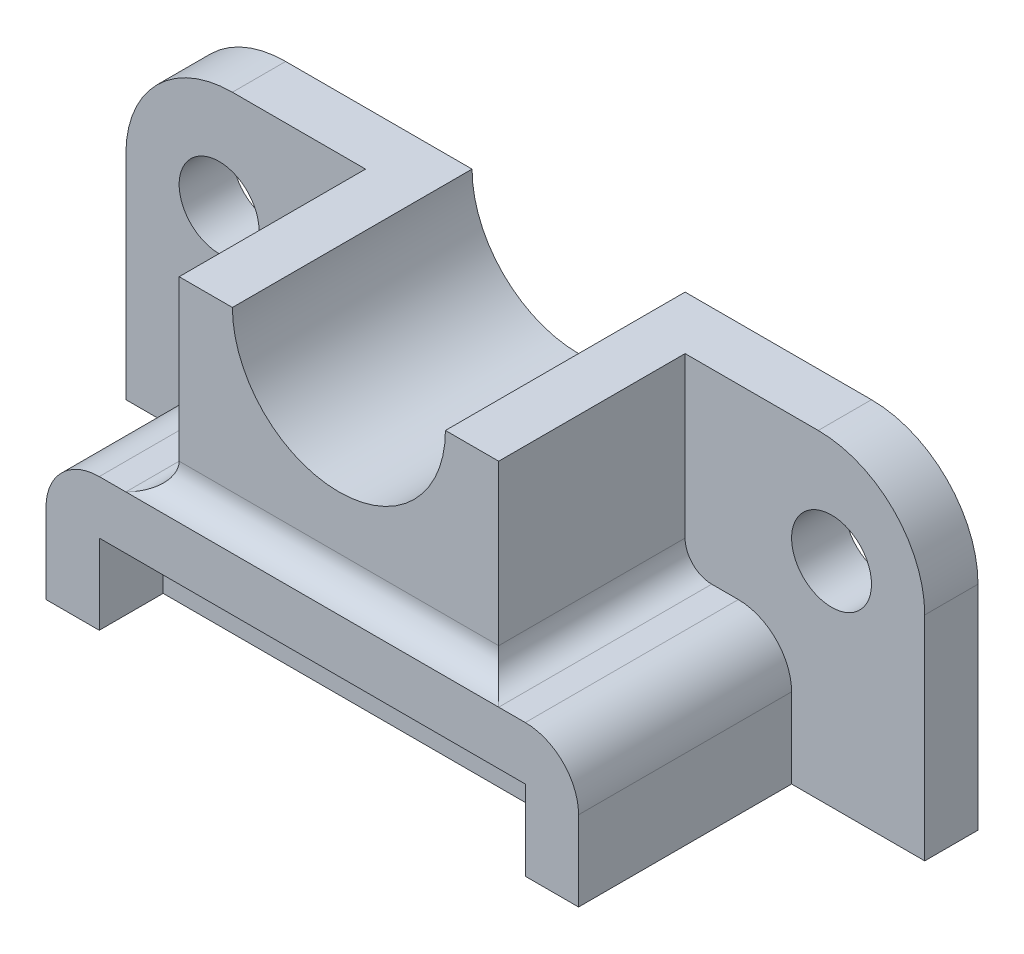
ISO-10303-21;
HEADER;
FILE_DESCRIPTION(('STEP AP214'),'2;1');
FILE_NAME('part.step','',(''),(''),'','','');
FILE_SCHEMA(('AUTOMOTIVE_DESIGN { 1 0 10303 214 1 1 1 1 }'));
ENDSEC;
DATA;
#1=APPLICATION_CONTEXT('core data for automotive mechanical design processes');
#2=APPLICATION_PROTOCOL_DEFINITION('international standard','automotive_design',2000,#1);
#3=PRODUCT_CONTEXT('',#1,'mechanical');
#4=PRODUCT('Part','Part','',(#3));
#5=PRODUCT_RELATED_PRODUCT_CATEGORY('part','',(#4));
#6=PRODUCT_DEFINITION_FORMATION('','',#4);
#7=PRODUCT_DEFINITION_CONTEXT('part definition',#1,'design');
#8=PRODUCT_DEFINITION('design','',#6,#7);
#9=PRODUCT_DEFINITION_SHAPE('','',#8);
#10=(LENGTH_UNIT() NAMED_UNIT(*) SI_UNIT(.MILLI.,.METRE.));
#11=(NAMED_UNIT(*) PLANE_ANGLE_UNIT() SI_UNIT($,.RADIAN.));
#12=(NAMED_UNIT(*) SI_UNIT($,.STERADIAN.) SOLID_ANGLE_UNIT());
#13=UNCERTAINTY_MEASURE_WITH_UNIT(LENGTH_MEASURE(1.E-05),#10,'distance_accuracy_value','');
#14=(GEOMETRIC_REPRESENTATION_CONTEXT(3) GLOBAL_UNCERTAINTY_ASSIGNED_CONTEXT((#13)) GLOBAL_UNIT_ASSIGNED_CONTEXT((#10,
#11,#12)) REPRESENTATION_CONTEXT('',''));
#15=CARTESIAN_POINT('',(0.,0.,0.));
#16=DIRECTION('',(0.,0.,1.));
#17=DIRECTION('',(1.,0.,0.));
#18=AXIS2_PLACEMENT_3D('',#15,#16,#17);
#19=CARTESIAN_POINT('',(0.,-5.,50.));
#20=DIRECTION('',(0.,-1.,0.));
#21=DIRECTION('',(1.,0.,0.));
#22=AXIS2_PLACEMENT_3D('',#19,#20,#21);
#23=PLANE('',#22);
#24=DIRECTION('',(-1.,0.,0.));
#25=VECTOR('',#24,1.);
#26=CARTESIAN_POINT('',(0.,-5.,50.));
#27=LINE('',#26,#25);
#28=CARTESIAN_POINT('',(-35.,-5.,50.));
#29=VERTEX_POINT('',#28);
#30=CARTESIAN_POINT('',(-40.,-5.00000000000001,50.));
#31=VERTEX_POINT('',#30);
#32=EDGE_CURVE('E366',#29,#31,#27,.T.);
#33=ORIENTED_EDGE('',*,*,#32,.F.);
#34=DIRECTION('',(0.,0.,-1.));
#35=VECTOR('',#34,1.);
#36=CARTESIAN_POINT('',(-35.,-5.,10.));
#37=LINE('',#36,#35);
#38=CARTESIAN_POINT('',(-35.,-5.,10.));
#39=VERTEX_POINT('',#38);
#40=EDGE_CURVE('E313',#29,#39,#37,.T.);
#41=ORIENTED_EDGE('',*,*,#40,.T.);
#42=DIRECTION('',(-1.,0.,0.));
#43=VECTOR('',#42,1.);
#44=CARTESIAN_POINT('',(0.,-5.,10.));
#45=LINE('',#44,#43);
#46=CARTESIAN_POINT('',(-40.,-5.00000000000001,10.));
#47=VERTEX_POINT('',#46);
#48=EDGE_CURVE('E308',#39,#47,#45,.T.);
#49=ORIENTED_EDGE('',*,*,#48,.T.);
#50=DIRECTION('',(0.,0.,-1.));
#51=VECTOR('',#50,1.);
#52=CARTESIAN_POINT('',(-40.,-5.00000000000001,50.));
#53=LINE('',#52,#51);
#54=EDGE_CURVE('E286',#47,#31,#53,.F.);
#55=ORIENTED_EDGE('',*,*,#54,.T.);
#56=EDGE_LOOP('',(#33,#41,#49,#55));
#57=FACE_BOUND('',#56,.T.);
#58=ADVANCED_FACE('F34',(#57),#23,.F.);
#59=CARTESIAN_POINT('',(75.,30.,10.));
#60=DIRECTION('',(0.,-1.,0.));
#61=DIRECTION('',(1.,0.,0.));
#62=AXIS2_PLACEMENT_3D('',#59,#60,#61);
#63=PLANE('',#62);
#64=DIRECTION('',(-1.,0.,0.));
#65=VECTOR('',#64,1.);
#66=CARTESIAN_POINT('',(75.,30.,0.));
#67=LINE('',#66,#65);
#68=CARTESIAN_POINT('',(55.,30.,0.));
#69=VERTEX_POINT('',#68);
#70=CARTESIAN_POINT('',(20.,30.,0.));
#71=VERTEX_POINT('',#70);
#72=EDGE_CURVE('E234',#69,#71,#67,.T.);
#73=ORIENTED_EDGE('',*,*,#72,.T.);
#74=DIRECTION('',(0.,0.,-1.));
#75=VECTOR('',#74,1.);
#76=CARTESIAN_POINT('',(20.,30.,45.));
#77=LINE('',#76,#75);
#78=CARTESIAN_POINT('',(20.,30.,45.));
#79=VERTEX_POINT('',#78);
#80=EDGE_CURVE('E354',#79,#71,#77,.T.);
#81=ORIENTED_EDGE('',*,*,#80,.F.);
#82=DIRECTION('',(-1.,0.,0.));
#83=VECTOR('',#82,1.);
#84=CARTESIAN_POINT('',(0.,30.,45.));
#85=LINE('',#84,#83);
#86=CARTESIAN_POINT('',(30.,30.,45.));
#87=VERTEX_POINT('',#86);
#88=EDGE_CURVE('E332',#87,#79,#85,.T.);
#89=ORIENTED_EDGE('',*,*,#88,.F.);
#90=DIRECTION('',(0.,0.,-1.));
#91=VECTOR('',#90,1.);
#92=CARTESIAN_POINT('',(30.,30.,45.));
#93=LINE('',#92,#91);
#94=CARTESIAN_POINT('',(30.,30.,10.));
#95=VERTEX_POINT('',#94);
#96=EDGE_CURVE('E345',#87,#95,#93,.T.);
#97=ORIENTED_EDGE('',*,*,#96,.T.);
#98=DIRECTION('',(-1.,0.,0.));
#99=VECTOR('',#98,1.);
#100=CARTESIAN_POINT('',(75.,30.,10.));
#101=LINE('',#100,#99);
#102=CARTESIAN_POINT('',(55.,30.,10.));
#103=VERTEX_POINT('',#102);
#104=EDGE_CURVE('E242',#103,#95,#101,.T.);
#105=ORIENTED_EDGE('',*,*,#104,.F.);
#106=DIRECTION('',(0.,0.,-1.));
#107=VECTOR('',#106,1.);
#108=CARTESIAN_POINT('',(55.,30.,10.));
#109=LINE('',#108,#107);
#110=EDGE_CURVE('E263',#103,#69,#109,.T.);
#111=ORIENTED_EDGE('',*,*,#110,.T.);
#112=EDGE_LOOP('',(#73,#81,#89,#97,#105,#111));
#113=FACE_BOUND('',#112,.T.);
#114=ADVANCED_FACE('F451',(#113),#63,.F.);
#115=CARTESIAN_POINT('',(0.,0.,10.));
#116=DIRECTION('',(0.,0.,1.));
#117=DIRECTION('',(1.,0.,0.));
#118=AXIS2_PLACEMENT_3D('',#115,#116,#117);
#119=PLANE('',#118);
#120=CARTESIAN_POINT('',(-57.5,10.,10.));
#121=DIRECTION('',(0.,0.,1.));
#122=DIRECTION('',(1.,0.,0.));
#123=AXIS2_PLACEMENT_3D('',#120,#121,#122);
#124=CIRCLE('',#123,7.5);
#125=CARTESIAN_POINT('',(-50.,10.,10.));
#126=VERTEX_POINT('',#125);
#127=EDGE_CURVE('E305',#126,#126,#124,.T.);
#128=ORIENTED_EDGE('',*,*,#127,.F.);
#129=EDGE_LOOP('',(#128));
#130=FACE_BOUND('',#129,.T.);
#131=ORIENTED_EDGE('',*,*,#48,.F.);
#132=CARTESIAN_POINT('',(-35.,0.,10.));
#133=DIRECTION('',(0.,0.,1.));
#134=DIRECTION('',(1.,0.,0.));
#135=AXIS2_PLACEMENT_3D('',#132,#133,#134);
#136=CIRCLE('',#135,5.);
#137=CARTESIAN_POINT('',(-30.,0.,10.));
#138=VERTEX_POINT('',#137);
#139=EDGE_CURVE('E317',#39,#138,#136,.T.);
#140=ORIENTED_EDGE('',*,*,#139,.T.);
#141=DIRECTION('',(0.,-1.,0.));
#142=VECTOR('',#141,1.);
#143=CARTESIAN_POINT('',(-30.,0.,10.));
#144=LINE('',#143,#142);
#145=CARTESIAN_POINT('',(-30.,30.,10.));
#146=VERTEX_POINT('',#145);
#147=EDGE_CURVE('E328',#146,#138,#144,.T.);
#148=ORIENTED_EDGE('',*,*,#147,.F.);
#149=CARTESIAN_POINT('',(-55.,30.,10.));
#150=VERTEX_POINT('',#149);
#151=EDGE_CURVE('E241',#146,#150,#101,.T.);
#152=ORIENTED_EDGE('',*,*,#151,.T.);
#153=CARTESIAN_POINT('',(-55.,10.,10.));
#154=DIRECTION('',(0.,0.,1.));
#155=DIRECTION('',(1.,0.,0.));
#156=AXIS2_PLACEMENT_3D('',#153,#154,#155);
#157=CIRCLE('',#156,20.);
#158=CARTESIAN_POINT('',(-75.,10.,10.));
#159=VERTEX_POINT('',#158);
#160=EDGE_CURVE('E273',#150,#159,#157,.T.);
#161=ORIENTED_EDGE('',*,*,#160,.T.);
#162=DIRECTION('',(0.,-1.,0.));
#163=VECTOR('',#162,1.);
#164=CARTESIAN_POINT('',(-75.,-30.,10.));
#165=LINE('',#164,#163);
#166=CARTESIAN_POINT('',(-75.,-30.,10.));
#167=VERTEX_POINT('',#166);
#168=EDGE_CURVE('E231',#159,#167,#165,.T.);
#169=ORIENTED_EDGE('',*,*,#168,.T.);
#170=DIRECTION('',(1.,0.,0.));
#171=VECTOR('',#170,1.);
#172=CARTESIAN_POINT('',(75.,-30.,10.));
#173=LINE('',#172,#171);
#174=CARTESIAN_POINT('',(-50.,-30.,10.));
#175=VERTEX_POINT('',#174);
#176=EDGE_CURVE('E235',#167,#175,#173,.T.);
#177=ORIENTED_EDGE('',*,*,#176,.T.);
#178=DIRECTION('',(0.,-1.,0.));
#179=VECTOR('',#178,1.);
#180=CARTESIAN_POINT('',(-50.,0.,10.));
#181=LINE('',#180,#179);
#182=CARTESIAN_POINT('',(-50.,-15.,10.));
#183=VERTEX_POINT('',#182);
#184=EDGE_CURVE('E382',#183,#175,#181,.T.);
#185=ORIENTED_EDGE('',*,*,#184,.F.);
#186=CARTESIAN_POINT('',(-40.,-15.,10.));
#187=DIRECTION('',(0.,0.,1.));
#188=DIRECTION('',(1.,0.,0.));
#189=AXIS2_PLACEMENT_3D('',#186,#187,#188);
#190=CIRCLE('',#189,10.);
#191=EDGE_CURVE('E295',#183,#47,#190,.F.);
#192=ORIENTED_EDGE('',*,*,#191,.T.);
#193=EDGE_LOOP('',(#131,#140,#148,#152,#161,#169,#177,#185,#192));
#194=FACE_BOUND('',#193,.T.);
#195=ADVANCED_FACE('F432',(#130,#194),#119,.T.);
#196=CARTESIAN_POINT('',(40.,-4.99999999999999,10.));
#197=VERTEX_POINT('',#196);
#198=CARTESIAN_POINT('',(35.,-5.,10.));
#199=VERTEX_POINT('',#198);
#200=EDGE_CURVE('E379',#197,#199,#45,.T.);
#201=ORIENTED_EDGE('',*,*,#200,.T.);
#202=DIRECTION('',(0.,0.,-1.));
#203=VECTOR('',#202,1.);
#204=CARTESIAN_POINT('',(35.,-5.,50.));
#205=LINE('',#204,#203);
#206=CARTESIAN_POINT('',(35.,-5.,50.));
#207=VERTEX_POINT('',#206);
#208=EDGE_CURVE('E311',#199,#207,#205,.F.);
#209=ORIENTED_EDGE('',*,*,#208,.T.);
#210=CARTESIAN_POINT('',(40.,-4.99999999999999,50.));
#211=VERTEX_POINT('',#210);
#212=EDGE_CURVE('E361',#211,#207,#27,.T.);
#213=ORIENTED_EDGE('',*,*,#212,.F.);
#214=DIRECTION('',(0.,0.,-1.));
#215=VECTOR('',#214,1.);
#216=CARTESIAN_POINT('',(40.,-4.99999999999999,50.));
#217=LINE('',#216,#215);
#218=EDGE_CURVE('E283',#211,#197,#217,.T.);
#219=ORIENTED_EDGE('',*,*,#218,.T.);
#220=EDGE_LOOP('',(#201,#209,#213,#219));
#221=FACE_BOUND('',#220,.T.);
#222=ADVANCED_FACE('F409',(#221),#23,.F.);
#223=CARTESIAN_POINT('',(-75.,-30.,10.));
#224=DIRECTION('',(1.,0.,0.));
#225=DIRECTION('',(0.,0.,-1.));
#226=AXIS2_PLACEMENT_3D('',#223,#224,#225);
#227=PLANE('',#226);
#228=ORIENTED_EDGE('',*,*,#168,.F.);
#229=DIRECTION('',(0.,0.,-1.));
#230=VECTOR('',#229,1.);
#231=CARTESIAN_POINT('',(-75.,10.,10.));
#232=LINE('',#231,#230);
#233=CARTESIAN_POINT('',(-75.,10.,0.));
#234=VERTEX_POINT('',#233);
#235=EDGE_CURVE('E277',#159,#234,#232,.T.);
#236=ORIENTED_EDGE('',*,*,#235,.T.);
#237=DIRECTION('',(0.,-1.,0.));
#238=VECTOR('',#237,1.);
#239=CARTESIAN_POINT('',(-75.,-30.,0.));
#240=LINE('',#239,#238);
#241=CARTESIAN_POINT('',(-75.,-30.,0.));
#242=VERTEX_POINT('',#241);
#243=EDGE_CURVE('E230',#234,#242,#240,.T.);
#244=ORIENTED_EDGE('',*,*,#243,.T.);
#245=DIRECTION('',(0.,0.,-1.));
#246=VECTOR('',#245,1.);
#247=CARTESIAN_POINT('',(-75.,-30.,10.));
#248=LINE('',#247,#246);
#249=EDGE_CURVE('E257',#167,#242,#248,.T.);
#250=ORIENTED_EDGE('',*,*,#249,.F.);
#251=EDGE_LOOP('',(#228,#236,#244,#250));
#252=FACE_BOUND('',#251,.T.);
#253=ADVANCED_FACE('F461',(#252),#227,.F.);
#254=CARTESIAN_POINT('',(75.,-30.,10.));
#255=DIRECTION('',(0.,1.,0.));
#256=DIRECTION('',(-1.,0.,0.));
#257=AXIS2_PLACEMENT_3D('',#254,#255,#256);
#258=PLANE('',#257);
#259=DIRECTION('',(1.,0.,0.));
#260=VECTOR('',#259,1.);
#261=CARTESIAN_POINT('',(75.,-30.,0.));
#262=LINE('',#261,#260);
#263=CARTESIAN_POINT('',(75.,-30.,0.));
#264=VERTEX_POINT('',#263);
#265=EDGE_CURVE('E247',#242,#264,#262,.T.);
#266=ORIENTED_EDGE('',*,*,#265,.T.);
#267=DIRECTION('',(0.,0.,-1.));
#268=VECTOR('',#267,1.);
#269=CARTESIAN_POINT('',(75.,-30.,10.));
#270=LINE('',#269,#268);
#271=CARTESIAN_POINT('',(75.,-30.,10.));
#272=VERTEX_POINT('',#271);
#273=EDGE_CURVE('E245',#272,#264,#270,.T.);
#274=ORIENTED_EDGE('',*,*,#273,.F.);
#275=CARTESIAN_POINT('',(50.,-30.,10.));
#276=VERTEX_POINT('',#275);
#277=EDGE_CURVE('E233',#276,#272,#173,.T.);
#278=ORIENTED_EDGE('',*,*,#277,.F.);
#279=DIRECTION('',(0.,0.,-1.));
#280=VECTOR('',#279,1.);
#281=CARTESIAN_POINT('',(50.,-30.,50.));
#282=LINE('',#281,#280);
#283=CARTESIAN_POINT('',(50.,-30.,50.));
#284=VERTEX_POINT('',#283);
#285=EDGE_CURVE('E221',#284,#276,#282,.T.);
#286=ORIENTED_EDGE('',*,*,#285,.F.);
#287=DIRECTION('',(1.,0.,0.));
#288=VECTOR('',#287,1.);
#289=CARTESIAN_POINT('',(0.,-30.,50.));
#290=LINE('',#289,#288);
#291=CARTESIAN_POINT('',(40.,-30.,50.));
#292=VERTEX_POINT('',#291);
#293=EDGE_CURVE('E371',#292,#284,#290,.T.);
#294=ORIENTED_EDGE('',*,*,#293,.F.);
#295=DIRECTION('',(0.,0.,-1.));
#296=VECTOR('',#295,1.);
#297=CARTESIAN_POINT('',(40.,-30.,50.));
#298=LINE('',#297,#296);
#299=CARTESIAN_POINT('',(40.,-30.,38.));
#300=VERTEX_POINT('',#299);
#301=EDGE_CURVE('E217',#292,#300,#298,.T.);
#302=ORIENTED_EDGE('',*,*,#301,.T.);
#303=DIRECTION('',(1.,0.,0.));
#304=VECTOR('',#303,1.);
#305=CARTESIAN_POINT('',(40.,-30.,38.));
#306=LINE('',#305,#304);
#307=CARTESIAN_POINT('',(-40.,-30.,38.));
#308=VERTEX_POINT('',#307);
#309=EDGE_CURVE('E51',#308,#300,#306,.T.);
#310=ORIENTED_EDGE('',*,*,#309,.F.);
#311=DIRECTION('',(0.,0.,-1.));
#312=VECTOR('',#311,1.);
#313=CARTESIAN_POINT('',(-40.,-30.,50.));
#314=LINE('',#313,#312);
#315=CARTESIAN_POINT('',(-40.,-30.,50.));
#316=VERTEX_POINT('',#315);
#317=EDGE_CURVE('E219',#316,#308,#314,.T.);
#318=ORIENTED_EDGE('',*,*,#317,.F.);
#319=CARTESIAN_POINT('',(-50.,-30.,50.));
#320=VERTEX_POINT('',#319);
#321=EDGE_CURVE('E368',#320,#316,#290,.T.);
#322=ORIENTED_EDGE('',*,*,#321,.F.);
#323=DIRECTION('',(0.,0.,-1.));
#324=VECTOR('',#323,1.);
#325=CARTESIAN_POINT('',(-50.,-30.,50.));
#326=LINE('',#325,#324);
#327=EDGE_CURVE('E227',#320,#175,#326,.T.);
#328=ORIENTED_EDGE('',*,*,#327,.T.);
#329=ORIENTED_EDGE('',*,*,#176,.F.);
#330=ORIENTED_EDGE('',*,*,#249,.T.);
#331=EDGE_LOOP('',(#266,#274,#278,#286,#294,#302,#310,#318,#322,#328,#329,#330));
#332=FACE_BOUND('',#331,.T.);
#333=ADVANCED_FACE('F395',(#332),#258,.F.);
#334=CARTESIAN_POINT('',(75.,-30.,10.));
#335=DIRECTION('',(-1.,0.,0.));
#336=DIRECTION('',(0.,0.,1.));
#337=AXIS2_PLACEMENT_3D('',#334,#335,#336);
#338=PLANE('',#337);
#339=DIRECTION('',(0.,1.,0.));
#340=VECTOR('',#339,1.);
#341=CARTESIAN_POINT('',(75.,-30.,0.));
#342=LINE('',#341,#340);
#343=CARTESIAN_POINT('',(75.,10.,0.));
#344=VERTEX_POINT('',#343);
#345=EDGE_CURVE('E249',#264,#344,#342,.T.);
#346=ORIENTED_EDGE('',*,*,#345,.T.);
#347=DIRECTION('',(0.,0.,-1.));
#348=VECTOR('',#347,1.);
#349=CARTESIAN_POINT('',(75.,10.,10.));
#350=LINE('',#349,#348);
#351=CARTESIAN_POINT('',(75.,10.,10.));
#352=VERTEX_POINT('',#351);
#353=EDGE_CURVE('E271',#344,#352,#350,.F.);
#354=ORIENTED_EDGE('',*,*,#353,.T.);
#355=DIRECTION('',(0.,1.,0.));
#356=VECTOR('',#355,1.);
#357=CARTESIAN_POINT('',(75.,-30.,10.));
#358=LINE('',#357,#356);
#359=EDGE_CURVE('E238',#272,#352,#358,.T.);
#360=ORIENTED_EDGE('',*,*,#359,.F.);
#361=ORIENTED_EDGE('',*,*,#273,.T.);
#362=EDGE_LOOP('',(#346,#354,#360,#361));
#363=FACE_BOUND('',#362,.T.);
#364=ADVANCED_FACE('F479',(#363),#338,.F.);
#365=DIRECTION('',(0.,0.,-1.));
#366=VECTOR('',#365,1.);
#367=CARTESIAN_POINT('',(-20.,30.,45.));
#368=LINE('',#367,#366);
#369=CARTESIAN_POINT('',(-20.,30.,45.));
#370=VERTEX_POINT('',#369);
#371=CARTESIAN_POINT('',(-20.,30.,0.));
#372=VERTEX_POINT('',#371);
#373=EDGE_CURVE('E352',#370,#372,#368,.T.);
#374=ORIENTED_EDGE('',*,*,#373,.T.);
#375=CARTESIAN_POINT('',(-55.,30.,0.));
#376=VERTEX_POINT('',#375);
#377=EDGE_CURVE('E252',#372,#376,#67,.T.);
#378=ORIENTED_EDGE('',*,*,#377,.T.);
#379=DIRECTION('',(0.,0.,-1.));
#380=VECTOR('',#379,1.);
#381=CARTESIAN_POINT('',(-55.,30.,10.));
#382=LINE('',#381,#380);
#383=EDGE_CURVE('E260',#376,#150,#382,.F.);
#384=ORIENTED_EDGE('',*,*,#383,.T.);
#385=ORIENTED_EDGE('',*,*,#151,.F.);
#386=DIRECTION('',(0.,0.,-1.));
#387=VECTOR('',#386,1.);
#388=CARTESIAN_POINT('',(-30.,30.,45.));
#389=LINE('',#388,#387);
#390=CARTESIAN_POINT('',(-30.,30.,45.));
#391=VERTEX_POINT('',#390);
#392=EDGE_CURVE('E350',#391,#146,#389,.T.);
#393=ORIENTED_EDGE('',*,*,#392,.F.);
#394=DIRECTION('',(-1.,0.,0.));
#395=VECTOR('',#394,1.);
#396=CARTESIAN_POINT('',(0.,30.,45.));
#397=LINE('',#396,#395);
#398=EDGE_CURVE('E338',#370,#391,#397,.T.);
#399=ORIENTED_EDGE('',*,*,#398,.F.);
#400=EDGE_LOOP('',(#374,#378,#384,#385,#393,#399));
#401=FACE_BOUND('',#400,.T.);
#402=ADVANCED_FACE('F458',(#401),#63,.F.);
#403=DIRECTION('',(0.,-1.,0.));
#404=VECTOR('',#403,1.);
#405=CARTESIAN_POINT('',(30.,0.,10.));
#406=LINE('',#405,#404);
#407=CARTESIAN_POINT('',(30.,0.,10.));
#408=VERTEX_POINT('',#407);
#409=EDGE_CURVE('E335',#95,#408,#406,.T.);
#410=ORIENTED_EDGE('',*,*,#409,.T.);
#411=CARTESIAN_POINT('',(35.,0.,10.));
#412=DIRECTION('',(0.,0.,1.));
#413=DIRECTION('',(1.,0.,0.));
#414=AXIS2_PLACEMENT_3D('',#411,#412,#413);
#415=CIRCLE('',#414,5.);
#416=EDGE_CURVE('E11',#408,#199,#415,.T.);
#417=ORIENTED_EDGE('',*,*,#416,.T.);
#418=ORIENTED_EDGE('',*,*,#200,.F.);
#419=CARTESIAN_POINT('',(40.,-15.,10.));
#420=DIRECTION('',(0.,0.,1.));
#421=DIRECTION('',(1.,0.,0.));
#422=AXIS2_PLACEMENT_3D('',#419,#420,#421);
#423=CIRCLE('',#422,10.);
#424=CARTESIAN_POINT('',(50.,-15.,10.));
#425=VERTEX_POINT('',#424);
#426=EDGE_CURVE('E298',#197,#425,#423,.F.);
#427=ORIENTED_EDGE('',*,*,#426,.T.);
#428=DIRECTION('',(0.,1.,0.));
#429=VECTOR('',#428,1.);
#430=CARTESIAN_POINT('',(50.,0.,10.));
#431=LINE('',#430,#429);
#432=EDGE_CURVE('E384',#276,#425,#431,.T.);
#433=ORIENTED_EDGE('',*,*,#432,.F.);
#434=ORIENTED_EDGE('',*,*,#277,.T.);
#435=ORIENTED_EDGE('',*,*,#359,.T.);
#436=CARTESIAN_POINT('',(55.,10.,10.));
#437=DIRECTION('',(0.,0.,1.));
#438=DIRECTION('',(1.,0.,0.));
#439=AXIS2_PLACEMENT_3D('',#436,#437,#438);
#440=CIRCLE('',#439,20.);
#441=EDGE_CURVE('E275',#352,#103,#440,.T.);
#442=ORIENTED_EDGE('',*,*,#441,.T.);
#443=ORIENTED_EDGE('',*,*,#104,.T.);
#444=EDGE_LOOP('',(#410,#417,#418,#427,#433,#434,#435,#442,#443));
#445=FACE_BOUND('',#444,.T.);
#446=CARTESIAN_POINT('',(57.5,10.,10.));
#447=DIRECTION('',(0.,0.,1.));
#448=DIRECTION('',(1.,0.,0.));
#449=AXIS2_PLACEMENT_3D('',#446,#447,#448);
#450=CIRCLE('',#449,7.50000000000001);
#451=CARTESIAN_POINT('',(65.,10.,10.));
#452=VERTEX_POINT('',#451);
#453=EDGE_CURVE('E356',#452,#452,#450,.T.);
#454=ORIENTED_EDGE('',*,*,#453,.F.);
#455=EDGE_LOOP('',(#454));
#456=FACE_BOUND('',#455,.T.);
#457=ADVANCED_FACE('F399',(#445,#456),#119,.T.);
#458=CARTESIAN_POINT('',(0.,0.,0.));
#459=DIRECTION('',(0.,0.,1.));
#460=DIRECTION('',(1.,0.,0.));
#461=AXIS2_PLACEMENT_3D('',#458,#459,#460);
#462=PLANE('',#461);
#463=ORIENTED_EDGE('',*,*,#345,.F.);
#464=ORIENTED_EDGE('',*,*,#265,.F.);
#465=ORIENTED_EDGE('',*,*,#243,.F.);
#466=CARTESIAN_POINT('',(-55.,10.,0.));
#467=DIRECTION('',(0.,0.,1.));
#468=DIRECTION('',(1.,0.,0.));
#469=AXIS2_PLACEMENT_3D('',#466,#467,#468);
#470=CIRCLE('',#469,20.);
#471=EDGE_CURVE('E266',#234,#376,#470,.F.);
#472=ORIENTED_EDGE('',*,*,#471,.T.);
#473=ORIENTED_EDGE('',*,*,#377,.F.);
#474=CARTESIAN_POINT('',(0.,30.,0.));
#475=DIRECTION('',(0.,0.,1.));
#476=DIRECTION('',(1.,0.,0.));
#477=AXIS2_PLACEMENT_3D('',#474,#475,#476);
#478=CIRCLE('',#477,20.);
#479=EDGE_CURVE('E300',#372,#71,#478,.T.);
#480=ORIENTED_EDGE('',*,*,#479,.T.);
#481=ORIENTED_EDGE('',*,*,#72,.F.);
#482=CARTESIAN_POINT('',(55.,10.,0.));
#483=DIRECTION('',(0.,0.,1.));
#484=DIRECTION('',(1.,0.,0.));
#485=AXIS2_PLACEMENT_3D('',#482,#483,#484);
#486=CIRCLE('',#485,20.);
#487=EDGE_CURVE('E269',#69,#344,#486,.F.);
#488=ORIENTED_EDGE('',*,*,#487,.T.);
#489=EDGE_LOOP('',(#463,#464,#465,#472,#473,#480,#481,#488));
#490=FACE_BOUND('',#489,.T.);
#491=CARTESIAN_POINT('',(57.5,10.,0.));
#492=DIRECTION('',(0.,0.,1.));
#493=DIRECTION('',(1.,0.,0.));
#494=AXIS2_PLACEMENT_3D('',#491,#492,#493);
#495=CIRCLE('',#494,7.50000000000001);
#496=CARTESIAN_POINT('',(65.,10.,0.));
#497=VERTEX_POINT('',#496);
#498=EDGE_CURVE('E301',#497,#497,#495,.F.);
#499=ORIENTED_EDGE('',*,*,#498,.F.);
#500=EDGE_LOOP('',(#499));
#501=FACE_BOUND('',#500,.T.);
#502=CARTESIAN_POINT('',(-57.5,10.,0.));
#503=DIRECTION('',(0.,0.,1.));
#504=DIRECTION('',(1.,0.,0.));
#505=AXIS2_PLACEMENT_3D('',#502,#503,#504);
#506=CIRCLE('',#505,7.5);
#507=CARTESIAN_POINT('',(-50.,10.,0.));
#508=VERTEX_POINT('',#507);
#509=EDGE_CURVE('E304',#508,#508,#506,.F.);
#510=ORIENTED_EDGE('',*,*,#509,.F.);
#511=EDGE_LOOP('',(#510));
#512=FACE_BOUND('',#511,.T.);
#513=ADVANCED_FACE('F448',(#490,#501,#512),#462,.F.);
#514=CARTESIAN_POINT('',(-50.,0.,50.));
#515=DIRECTION('',(1.,0.,0.));
#516=DIRECTION('',(0.,1.,0.));
#517=AXIS2_PLACEMENT_3D('',#514,#515,#516);
#518=PLANE('',#517);
#519=DIRECTION('',(0.,-1.,0.));
#520=VECTOR('',#519,1.);
#521=CARTESIAN_POINT('',(-50.,0.,50.));
#522=LINE('',#521,#520);
#523=CARTESIAN_POINT('',(-50.,-15.,50.));
#524=VERTEX_POINT('',#523);
#525=EDGE_CURVE('E364',#524,#320,#522,.T.);
#526=ORIENTED_EDGE('',*,*,#525,.F.);
#527=DIRECTION('',(0.,0.,-1.));
#528=VECTOR('',#527,1.);
#529=CARTESIAN_POINT('',(-50.,-15.,50.));
#530=LINE('',#529,#528);
#531=EDGE_CURVE('E280',#524,#183,#530,.T.);
#532=ORIENTED_EDGE('',*,*,#531,.T.);
#533=ORIENTED_EDGE('',*,*,#184,.T.);
#534=ORIENTED_EDGE('',*,*,#327,.F.);
#535=EDGE_LOOP('',(#526,#532,#533,#534));
#536=FACE_BOUND('',#535,.T.);
#537=ADVANCED_FACE('F429',(#536),#518,.F.);
#538=CARTESIAN_POINT('',(-40.,0.,50.));
#539=DIRECTION('',(-1.,0.,0.));
#540=DIRECTION('',(0.,0.,1.));
#541=AXIS2_PLACEMENT_3D('',#538,#539,#540);
#542=PLANE('',#541);
#543=ORIENTED_EDGE('',*,*,#317,.T.);
#544=DIRECTION('',(0.,-1.,0.));
#545=VECTOR('',#544,1.);
#546=CARTESIAN_POINT('',(-40.,-30.,38.));
#547=LINE('',#546,#545);
#548=CARTESIAN_POINT('',(-40.,-15.,38.));
#549=VERTEX_POINT('',#548);
#550=EDGE_CURVE('E213',#549,#308,#547,.T.);
#551=ORIENTED_EDGE('',*,*,#550,.F.);
#552=DIRECTION('',(0.,0.,-1.));
#553=VECTOR('',#552,1.);
#554=CARTESIAN_POINT('',(-40.,-15.,50.));
#555=LINE('',#554,#553);
#556=CARTESIAN_POINT('',(-40.,-15.,50.));
#557=VERTEX_POINT('',#556);
#558=EDGE_CURVE('E212',#557,#549,#555,.T.);
#559=ORIENTED_EDGE('',*,*,#558,.F.);
#560=DIRECTION('',(0.,1.,0.));
#561=VECTOR('',#560,1.);
#562=CARTESIAN_POINT('',(-40.,0.,50.));
#563=LINE('',#562,#561);
#564=EDGE_CURVE('E370',#316,#557,#563,.T.);
#565=ORIENTED_EDGE('',*,*,#564,.F.);
#566=EDGE_LOOP('',(#543,#551,#559,#565));
#567=FACE_BOUND('',#566,.T.);
#568=ADVANCED_FACE('F440',(#567),#542,.F.);
#569=CARTESIAN_POINT('',(0.,-15.,50.));
#570=DIRECTION('',(0.,1.,0.));
#571=DIRECTION('',(0.,0.,1.));
#572=AXIS2_PLACEMENT_3D('',#569,#570,#571);
#573=PLANE('',#572);
#574=ORIENTED_EDGE('',*,*,#558,.T.);
#575=DIRECTION('',(-1.,0.,0.));
#576=VECTOR('',#575,1.);
#577=CARTESIAN_POINT('',(40.,-15.,38.));
#578=LINE('',#577,#576);
#579=CARTESIAN_POINT('',(40.,-15.,38.));
#580=VERTEX_POINT('',#579);
#581=EDGE_CURVE('E197',#580,#549,#578,.T.);
#582=ORIENTED_EDGE('',*,*,#581,.F.);
#583=DIRECTION('',(0.,0.,-1.));
#584=VECTOR('',#583,1.);
#585=CARTESIAN_POINT('',(40.,-15.,50.));
#586=LINE('',#585,#584);
#587=CARTESIAN_POINT('',(40.,-15.,50.));
#588=VERTEX_POINT('',#587);
#589=EDGE_CURVE('E209',#588,#580,#586,.T.);
#590=ORIENTED_EDGE('',*,*,#589,.F.);
#591=DIRECTION('',(1.,0.,0.));
#592=VECTOR('',#591,1.);
#593=CARTESIAN_POINT('',(0.,-15.,50.));
#594=LINE('',#593,#592);
#595=EDGE_CURVE('E373',#557,#588,#594,.T.);
#596=ORIENTED_EDGE('',*,*,#595,.F.);
#597=EDGE_LOOP('',(#574,#582,#590,#596));
#598=FACE_BOUND('',#597,.T.);
#599=ADVANCED_FACE('F207',(#598),#573,.F.);
#600=CARTESIAN_POINT('',(40.,0.,50.));
#601=DIRECTION('',(1.,0.,0.));
#602=DIRECTION('',(0.,1.,0.));
#603=AXIS2_PLACEMENT_3D('',#600,#601,#602);
#604=PLANE('',#603);
#605=ORIENTED_EDGE('',*,*,#589,.T.);
#606=DIRECTION('',(0.,1.,0.));
#607=VECTOR('',#606,1.);
#608=CARTESIAN_POINT('',(40.,-30.,38.));
#609=LINE('',#608,#607);
#610=EDGE_CURVE('E194',#300,#580,#609,.T.);
#611=ORIENTED_EDGE('',*,*,#610,.F.);
#612=ORIENTED_EDGE('',*,*,#301,.F.);
#613=DIRECTION('',(0.,-1.,0.));
#614=VECTOR('',#613,1.);
#615=CARTESIAN_POINT('',(40.,0.,50.));
#616=LINE('',#615,#614);
#617=EDGE_CURVE('E216',#588,#292,#616,.T.);
#618=ORIENTED_EDGE('',*,*,#617,.F.);
#619=EDGE_LOOP('',(#605,#611,#612,#618));
#620=FACE_BOUND('',#619,.T.);
#621=ADVANCED_FACE('F215',(#620),#604,.F.);
#622=CARTESIAN_POINT('',(50.,0.,50.));
#623=DIRECTION('',(-1.,0.,0.));
#624=DIRECTION('',(0.,0.,1.));
#625=AXIS2_PLACEMENT_3D('',#622,#623,#624);
#626=PLANE('',#625);
#627=ORIENTED_EDGE('',*,*,#432,.T.);
#628=DIRECTION('',(0.,0.,-1.));
#629=VECTOR('',#628,1.);
#630=CARTESIAN_POINT('',(50.,-15.,50.));
#631=LINE('',#630,#629);
#632=CARTESIAN_POINT('',(50.,-15.,50.));
#633=VERTEX_POINT('',#632);
#634=EDGE_CURVE('E293',#425,#633,#631,.F.);
#635=ORIENTED_EDGE('',*,*,#634,.T.);
#636=DIRECTION('',(0.,1.,0.));
#637=VECTOR('',#636,1.);
#638=CARTESIAN_POINT('',(50.,0.,50.));
#639=LINE('',#638,#637);
#640=EDGE_CURVE('E376',#284,#633,#639,.T.);
#641=ORIENTED_EDGE('',*,*,#640,.F.);
#642=ORIENTED_EDGE('',*,*,#285,.T.);
#643=EDGE_LOOP('',(#627,#635,#641,#642));
#644=FACE_BOUND('',#643,.T.);
#645=ADVANCED_FACE('F390',(#644),#626,.F.);
#646=CARTESIAN_POINT('',(0.,0.,50.));
#647=DIRECTION('',(0.,0.,1.));
#648=DIRECTION('',(1.,0.,0.));
#649=AXIS2_PLACEMENT_3D('',#646,#647,#648);
#650=PLANE('',#649);
#651=ORIENTED_EDGE('',*,*,#212,.T.);
#652=EDGE_CURVE('E365',#207,#29,#27,.T.);
#653=ORIENTED_EDGE('',*,*,#652,.T.);
#654=ORIENTED_EDGE('',*,*,#32,.T.);
#655=CARTESIAN_POINT('',(-40.,-15.,50.));
#656=DIRECTION('',(0.,0.,1.));
#657=DIRECTION('',(1.,0.,0.));
#658=AXIS2_PLACEMENT_3D('',#655,#656,#657);
#659=CIRCLE('',#658,10.);
#660=EDGE_CURVE('E291',#31,#524,#659,.T.);
#661=ORIENTED_EDGE('',*,*,#660,.T.);
#662=ORIENTED_EDGE('',*,*,#525,.T.);
#663=ORIENTED_EDGE('',*,*,#321,.T.);
#664=ORIENTED_EDGE('',*,*,#564,.T.);
#665=ORIENTED_EDGE('',*,*,#595,.T.);
#666=ORIENTED_EDGE('',*,*,#617,.T.);
#667=ORIENTED_EDGE('',*,*,#293,.T.);
#668=ORIENTED_EDGE('',*,*,#640,.T.);
#669=CARTESIAN_POINT('',(40.,-15.,50.));
#670=DIRECTION('',(0.,0.,1.));
#671=DIRECTION('',(1.,0.,0.));
#672=AXIS2_PLACEMENT_3D('',#669,#670,#671);
#673=CIRCLE('',#672,10.);
#674=EDGE_CURVE('E289',#633,#211,#673,.T.);
#675=ORIENTED_EDGE('',*,*,#674,.T.);
#676=EDGE_LOOP('',(#651,#653,#654,#661,#662,#663,#664,#665,#666,#667,#668,#675));
#677=FACE_BOUND('',#676,.T.);
#678=ADVANCED_FACE('F414',(#677),#650,.T.);
#679=CARTESIAN_POINT('',(55.,10.,10.));
#680=DIRECTION('',(0.,0.,-1.));
#681=DIRECTION('',(-1.,0.,0.));
#682=AXIS2_PLACEMENT_3D('',#679,#680,#681);
#683=CYLINDRICAL_SURFACE('',#682,20.);
#684=ORIENTED_EDGE('',*,*,#441,.F.);
#685=ORIENTED_EDGE('',*,*,#353,.F.);
#686=ORIENTED_EDGE('',*,*,#487,.F.);
#687=ORIENTED_EDGE('',*,*,#110,.F.);
#688=EDGE_LOOP('',(#684,#685,#686,#687));
#689=FACE_BOUND('',#688,.T.);
#690=ADVANCED_FACE('F489',(#689),#683,.T.);
#691=CARTESIAN_POINT('',(-55.,10.,10.));
#692=DIRECTION('',(0.,0.,-1.));
#693=DIRECTION('',(-1.,0.,0.));
#694=AXIS2_PLACEMENT_3D('',#691,#692,#693);
#695=CYLINDRICAL_SURFACE('',#694,20.);
#696=ORIENTED_EDGE('',*,*,#160,.F.);
#697=ORIENTED_EDGE('',*,*,#383,.F.);
#698=ORIENTED_EDGE('',*,*,#471,.F.);
#699=ORIENTED_EDGE('',*,*,#235,.F.);
#700=EDGE_LOOP('',(#696,#697,#698,#699));
#701=FACE_BOUND('',#700,.T.);
#702=ADVANCED_FACE('F492',(#701),#695,.T.);
#703=CARTESIAN_POINT('',(-40.,-15.,50.));
#704=DIRECTION('',(0.,0.,-1.));
#705=DIRECTION('',(-1.,0.,0.));
#706=AXIS2_PLACEMENT_3D('',#703,#704,#705);
#707=CYLINDRICAL_SURFACE('',#706,10.);
#708=ORIENTED_EDGE('',*,*,#660,.F.);
#709=ORIENTED_EDGE('',*,*,#54,.F.);
#710=ORIENTED_EDGE('',*,*,#191,.F.);
#711=ORIENTED_EDGE('',*,*,#531,.F.);
#712=EDGE_LOOP('',(#708,#709,#710,#711));
#713=FACE_BOUND('',#712,.T.);
#714=ADVANCED_FACE('F426',(#713),#707,.T.);
#715=CARTESIAN_POINT('',(40.,-15.,50.));
#716=DIRECTION('',(0.,0.,-1.));
#717=DIRECTION('',(-1.,0.,0.));
#718=AXIS2_PLACEMENT_3D('',#715,#716,#717);
#719=CYLINDRICAL_SURFACE('',#718,10.);
#720=ORIENTED_EDGE('',*,*,#674,.F.);
#721=ORIENTED_EDGE('',*,*,#634,.F.);
#722=ORIENTED_EDGE('',*,*,#426,.F.);
#723=ORIENTED_EDGE('',*,*,#218,.F.);
#724=EDGE_LOOP('',(#720,#721,#722,#723));
#725=FACE_BOUND('',#724,.T.);
#726=ADVANCED_FACE('F406',(#725),#719,.T.);
#727=CARTESIAN_POINT('',(57.5,10.,10.));
#728=DIRECTION('',(0.,0.,-1.));
#729=DIRECTION('',(-1.,0.,0.));
#730=AXIS2_PLACEMENT_3D('',#727,#728,#729);
#731=CYLINDRICAL_SURFACE('',#730,7.50000000000001);
#732=ORIENTED_EDGE('',*,*,#453,.T.);
#733=EDGE_LOOP('',(#732));
#734=FACE_BOUND('',#733,.T.);
#735=ORIENTED_EDGE('',*,*,#498,.T.);
#736=EDGE_LOOP('',(#735));
#737=FACE_BOUND('',#736,.T.);
#738=ADVANCED_FACE('F501',(#734,#737),#731,.F.);
#739=CARTESIAN_POINT('',(-57.5,10.,10.));
#740=DIRECTION('',(0.,0.,-1.));
#741=DIRECTION('',(-1.,0.,0.));
#742=AXIS2_PLACEMENT_3D('',#739,#740,#741);
#743=CYLINDRICAL_SURFACE('',#742,7.5);
#744=ORIENTED_EDGE('',*,*,#127,.T.);
#745=EDGE_LOOP('',(#744));
#746=FACE_BOUND('',#745,.T.);
#747=ORIENTED_EDGE('',*,*,#509,.T.);
#748=EDGE_LOOP('',(#747));
#749=FACE_BOUND('',#748,.T.);
#750=ADVANCED_FACE('F550',(#746,#749),#743,.F.);
#751=CARTESIAN_POINT('',(0.,30.,45.));
#752=DIRECTION('',(0.,0.,-1.));
#753=DIRECTION('',(-1.,0.,0.));
#754=AXIS2_PLACEMENT_3D('',#751,#752,#753);
#755=CYLINDRICAL_SURFACE('',#754,20.);
#756=ORIENTED_EDGE('',*,*,#80,.T.);
#757=ORIENTED_EDGE('',*,*,#479,.F.);
#758=ORIENTED_EDGE('',*,*,#373,.F.);
#759=CARTESIAN_POINT('',(0.,30.,45.));
#760=DIRECTION('',(0.,0.,1.));
#761=DIRECTION('',(1.,0.,0.));
#762=AXIS2_PLACEMENT_3D('',#759,#760,#761);
#763=CIRCLE('',#762,20.);
#764=EDGE_CURVE('E334',#370,#79,#763,.T.);
#765=ORIENTED_EDGE('',*,*,#764,.T.);
#766=EDGE_LOOP('',(#756,#757,#758,#765));
#767=FACE_BOUND('',#766,.T.);
#768=ADVANCED_FACE('F544',(#767),#755,.F.);
#769=CARTESIAN_POINT('',(-30.,0.,45.));
#770=DIRECTION('',(1.,0.,0.));
#771=DIRECTION('',(0.,0.,-1.));
#772=AXIS2_PLACEMENT_3D('',#769,#770,#771);
#773=PLANE('',#772);
#774=ORIENTED_EDGE('',*,*,#147,.T.);
#775=DIRECTION('',(0.,0.,-1.));
#776=VECTOR('',#775,1.);
#777=CARTESIAN_POINT('',(-30.,0.,45.));
#778=LINE('',#777,#776);
#779=CARTESIAN_POINT('',(-30.,0.,45.));
#780=VERTEX_POINT('',#779);
#781=EDGE_CURVE('E319',#138,#780,#778,.F.);
#782=ORIENTED_EDGE('',*,*,#781,.T.);
#783=DIRECTION('',(0.,-1.,0.));
#784=VECTOR('',#783,1.);
#785=CARTESIAN_POINT('',(-30.,0.,45.));
#786=LINE('',#785,#784);
#787=EDGE_CURVE('E340',#391,#780,#786,.T.);
#788=ORIENTED_EDGE('',*,*,#787,.F.);
#789=ORIENTED_EDGE('',*,*,#392,.T.);
#790=EDGE_LOOP('',(#774,#782,#788,#789));
#791=FACE_BOUND('',#790,.T.);
#792=ADVANCED_FACE('F515',(#791),#773,.F.);
#793=CARTESIAN_POINT('',(30.,0.,45.));
#794=DIRECTION('',(1.,0.,0.));
#795=DIRECTION('',(0.,0.,-1.));
#796=AXIS2_PLACEMENT_3D('',#793,#794,#795);
#797=PLANE('',#796);
#798=DIRECTION('',(0.,-1.,0.));
#799=VECTOR('',#798,1.);
#800=CARTESIAN_POINT('',(30.,0.,45.));
#801=LINE('',#800,#799);
#802=CARTESIAN_POINT('',(30.,0.,45.));
#803=VERTEX_POINT('',#802);
#804=EDGE_CURVE('E343',#87,#803,#801,.T.);
#805=ORIENTED_EDGE('',*,*,#804,.T.);
#806=DIRECTION('',(0.,0.,-1.));
#807=VECTOR('',#806,1.);
#808=CARTESIAN_POINT('',(30.,0.,45.));
#809=LINE('',#808,#807);
#810=EDGE_CURVE('E43',#803,#408,#809,.T.);
#811=ORIENTED_EDGE('',*,*,#810,.T.);
#812=ORIENTED_EDGE('',*,*,#409,.F.);
#813=ORIENTED_EDGE('',*,*,#96,.F.);
#814=EDGE_LOOP('',(#805,#811,#812,#813));
#815=FACE_BOUND('',#814,.T.);
#816=ADVANCED_FACE('F535',(#815),#797,.T.);
#817=CARTESIAN_POINT('',(0.,30.,45.));
#818=DIRECTION('',(0.,0.,1.));
#819=DIRECTION('',(1.,0.,0.));
#820=AXIS2_PLACEMENT_3D('',#817,#818,#819);
#821=PLANE('',#820);
#822=ORIENTED_EDGE('',*,*,#787,.T.);
#823=DIRECTION('',(-1.,0.,0.));
#824=VECTOR('',#823,1.);
#825=CARTESIAN_POINT('',(0.,0.,45.));
#826=LINE('',#825,#824);
#827=EDGE_CURVE('E315',#780,#803,#826,.F.);
#828=ORIENTED_EDGE('',*,*,#827,.T.);
#829=ORIENTED_EDGE('',*,*,#804,.F.);
#830=ORIENTED_EDGE('',*,*,#88,.T.);
#831=ORIENTED_EDGE('',*,*,#764,.F.);
#832=ORIENTED_EDGE('',*,*,#398,.T.);
#833=EDGE_LOOP('',(#822,#828,#829,#830,#831,#832));
#834=FACE_BOUND('',#833,.T.);
#835=ADVANCED_FACE('F509',(#834),#821,.T.);
#836=CARTESIAN_POINT('',(35.,0.,45.));
#837=DIRECTION('',(0.,0.,-1.));
#838=DIRECTION('',(-1.,0.,0.));
#839=AXIS2_PLACEMENT_3D('',#836,#837,#838);
#840=CYLINDRICAL_SURFACE('',#839,5.);
#841=ORIENTED_EDGE('',*,*,#416,.F.);
#842=ORIENTED_EDGE('',*,*,#810,.F.);
#843=CARTESIAN_POINT('',(35.,0.,50.));
#844=DIRECTION('',(0.707106781186547,0.,-0.707106781186547));
#845=DIRECTION('',(-0.707106781186547,0.,-0.707106781186547));
#846=AXIS2_PLACEMENT_3D('',#843,#844,#845);
#847=ELLIPSE('',#846,7.07106781186547,5.);
#848=EDGE_CURVE('E38',#207,#803,#847,.T.);
#849=ORIENTED_EDGE('',*,*,#848,.F.);
#850=ORIENTED_EDGE('',*,*,#208,.F.);
#851=EDGE_LOOP('',(#841,#842,#849,#850));
#852=FACE_BOUND('',#851,.T.);
#853=ADVANCED_FACE('F36',(#852),#840,.F.);
#854=CARTESIAN_POINT('',(-35.,0.,50.));
#855=DIRECTION('',(0.,0.,1.));
#856=DIRECTION('',(1.,0.,0.));
#857=AXIS2_PLACEMENT_3D('',#854,#855,#856);
#858=CYLINDRICAL_SURFACE('',#857,5.);
#859=ORIENTED_EDGE('',*,*,#139,.F.);
#860=ORIENTED_EDGE('',*,*,#40,.F.);
#861=CARTESIAN_POINT('',(-35.,0.,50.));
#862=DIRECTION('',(0.707106781186547,0.,0.707106781186547));
#863=DIRECTION('',(-0.707106781186547,0.,0.707106781186547));
#864=AXIS2_PLACEMENT_3D('',#861,#862,#863);
#865=ELLIPSE('',#864,7.07106781186547,5.);
#866=EDGE_CURVE('E321',#780,#29,#865,.F.);
#867=ORIENTED_EDGE('',*,*,#866,.F.);
#868=ORIENTED_EDGE('',*,*,#781,.F.);
#869=EDGE_LOOP('',(#859,#860,#867,#868));
#870=FACE_BOUND('',#869,.T.);
#871=ADVANCED_FACE('F503',(#870),#858,.F.);
#872=CARTESIAN_POINT('',(0.,0.,50.));
#873=DIRECTION('',(-1.,0.,0.));
#874=DIRECTION('',(0.,-1.,0.));
#875=AXIS2_PLACEMENT_3D('',#872,#873,#874);
#876=CYLINDRICAL_SURFACE('',#875,5.);
#877=ORIENTED_EDGE('',*,*,#848,.T.);
#878=ORIENTED_EDGE('',*,*,#827,.F.);
#879=ORIENTED_EDGE('',*,*,#866,.T.);
#880=ORIENTED_EDGE('',*,*,#652,.F.);
#881=EDGE_LOOP('',(#877,#878,#879,#880));
#882=FACE_BOUND('',#881,.T.);
#883=ADVANCED_FACE('F417',(#882),#876,.F.);
#884=CARTESIAN_POINT('',(0.,0.,38.));
#885=DIRECTION('',(0.,0.,1.));
#886=DIRECTION('',(1.,0.,0.));
#887=AXIS2_PLACEMENT_3D('',#884,#885,#886);
#888=PLANE('',#887);
#889=ORIENTED_EDGE('',*,*,#610,.T.);
#890=ORIENTED_EDGE('',*,*,#581,.T.);
#891=ORIENTED_EDGE('',*,*,#550,.T.);
#892=ORIENTED_EDGE('',*,*,#309,.T.);
#893=EDGE_LOOP('',(#889,#890,#891,#892));
#894=FACE_BOUND('',#893,.T.);
#895=ADVANCED_FACE('F196',(#894),#888,.T.);
#896=CLOSED_SHELL('',(#58,#114,#195,#222,#253,#333,#364,#402,#457,#513,#537,#568,#599,#621,#645,
#678,#690,#702,#714,#726,#738,#750,#768,#792,#816,#835,#853,#871,#883,#895));
#897=MANIFOLD_SOLID_BREP('B2',#896);
#898=ADVANCED_BREP_SHAPE_REPRESENTATION('',(#18,#897),#14);
#899=SHAPE_DEFINITION_REPRESENTATION(#9,#898);
ENDSEC;
END-ISO-10303-21;
